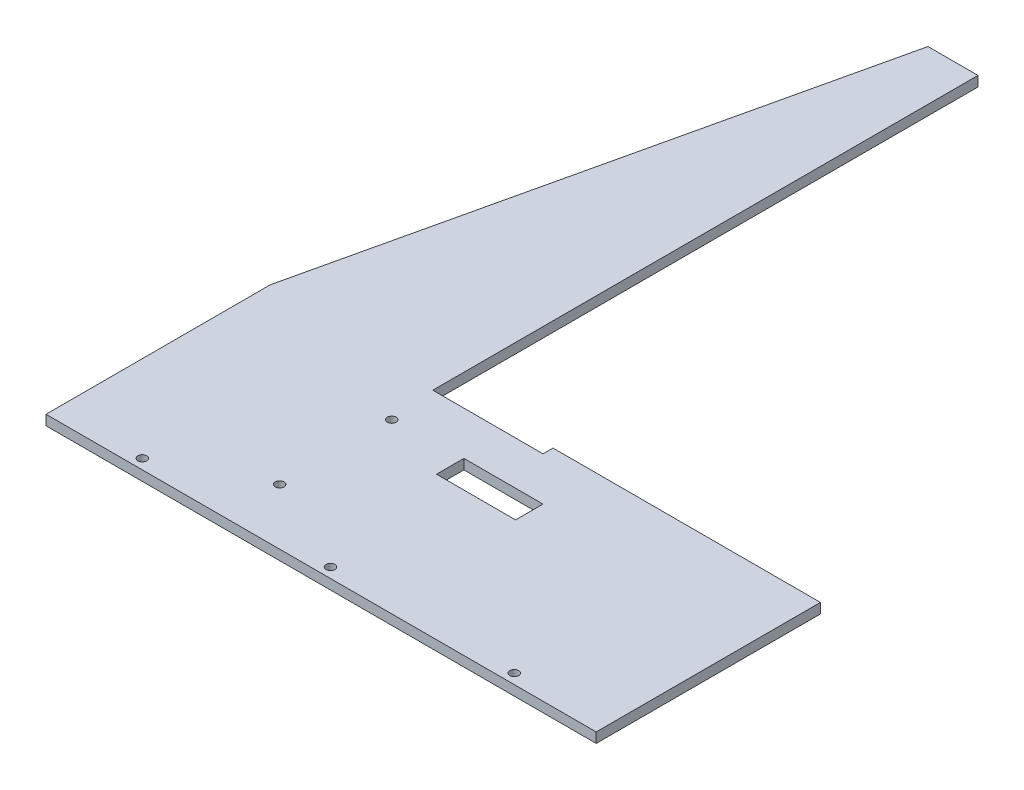
ISO-10303-21;
HEADER;
FILE_DESCRIPTION(('STEP AP214'),'2;1');
FILE_NAME('part.step','',(''),(''),'','','');
FILE_SCHEMA(('AUTOMOTIVE_DESIGN { 1 0 10303 214 1 1 1 1 }'));
ENDSEC;
DATA;
#1=APPLICATION_CONTEXT('core data for automotive mechanical design processes');
#2=APPLICATION_PROTOCOL_DEFINITION('international standard','automotive_design',2000,#1);
#3=PRODUCT_CONTEXT('',#1,'mechanical');
#4=PRODUCT('Part','Part','',(#3));
#5=PRODUCT_RELATED_PRODUCT_CATEGORY('part','',(#4));
#6=PRODUCT_DEFINITION_FORMATION('','',#4);
#7=PRODUCT_DEFINITION_CONTEXT('part definition',#1,'design');
#8=PRODUCT_DEFINITION('design','',#6,#7);
#9=PRODUCT_DEFINITION_SHAPE('','',#8);
#10=(LENGTH_UNIT() NAMED_UNIT(*) SI_UNIT(.MILLI.,.METRE.));
#11=(NAMED_UNIT(*) PLANE_ANGLE_UNIT() SI_UNIT($,.RADIAN.));
#12=(NAMED_UNIT(*) SI_UNIT($,.STERADIAN.) SOLID_ANGLE_UNIT());
#13=UNCERTAINTY_MEASURE_WITH_UNIT(LENGTH_MEASURE(1.E-05),#10,'distance_accuracy_value','');
#14=(GEOMETRIC_REPRESENTATION_CONTEXT(3) GLOBAL_UNCERTAINTY_ASSIGNED_CONTEXT((#13)) GLOBAL_UNIT_ASSIGNED_CONTEXT((#10,
#11,#12)) REPRESENTATION_CONTEXT('',''));
#15=CARTESIAN_POINT('',(0.,0.,0.));
#16=DIRECTION('',(0.,0.,1.));
#17=DIRECTION('',(1.,0.,0.));
#18=AXIS2_PLACEMENT_3D('',#15,#16,#17);
#19=CARTESIAN_POINT('',(330.,6.,0.));
#20=DIRECTION('',(0.,0.,-1.));
#21=DIRECTION('',(-1.,0.,0.));
#22=AXIS2_PLACEMENT_3D('',#19,#20,#21);
#23=PLANE('',#22);
#24=DIRECTION('',(1.,0.,0.));
#25=VECTOR('',#24,1.);
#26=CARTESIAN_POINT('',(330.,0.,0.));
#27=LINE('',#26,#25);
#28=CARTESIAN_POINT('',(0.,0.,0.));
#29=VERTEX_POINT('',#28);
#30=CARTESIAN_POINT('',(330.,0.,0.));
#31=VERTEX_POINT('',#30);
#32=EDGE_CURVE('E216',#29,#31,#27,.T.);
#33=ORIENTED_EDGE('',*,*,#32,.T.);
#34=DIRECTION('',(0.,-1.,0.));
#35=VECTOR('',#34,1.);
#36=CARTESIAN_POINT('',(330.,6.,0.));
#37=LINE('',#36,#35);
#38=CARTESIAN_POINT('',(330.,6.,0.));
#39=VERTEX_POINT('',#38);
#40=EDGE_CURVE('E11',#39,#31,#37,.T.);
#41=ORIENTED_EDGE('',*,*,#40,.F.);
#42=DIRECTION('',(1.,0.,0.));
#43=VECTOR('',#42,1.);
#44=CARTESIAN_POINT('',(330.,6.,0.));
#45=LINE('',#44,#43);
#46=CARTESIAN_POINT('',(0.,6.,0.));
#47=VERTEX_POINT('',#46);
#48=EDGE_CURVE('E217',#47,#39,#45,.T.);
#49=ORIENTED_EDGE('',*,*,#48,.F.);
#50=DIRECTION('',(0.,-1.,0.));
#51=VECTOR('',#50,1.);
#52=CARTESIAN_POINT('',(0.,6.,0.));
#53=LINE('',#52,#51);
#54=EDGE_CURVE('E234',#47,#29,#53,.T.);
#55=ORIENTED_EDGE('',*,*,#54,.T.);
#56=EDGE_LOOP('',(#33,#41,#49,#55));
#57=FACE_BOUND('',#56,.T.);
#58=ADVANCED_FACE('F37',(#57),#23,.F.);
#59=CARTESIAN_POINT('',(330.,6.,-134.5));
#60=DIRECTION('',(-1.,0.,0.));
#61=DIRECTION('',(0.,0.,1.));
#62=AXIS2_PLACEMENT_3D('',#59,#60,#61);
#63=PLANE('',#62);
#64=DIRECTION('',(0.,0.,-1.));
#65=VECTOR('',#64,1.);
#66=CARTESIAN_POINT('',(330.,0.,-134.5));
#67=LINE('',#66,#65);
#68=CARTESIAN_POINT('',(330.,0.,-134.5));
#69=VERTEX_POINT('',#68);
#70=EDGE_CURVE('E237',#31,#69,#67,.T.);
#71=ORIENTED_EDGE('',*,*,#70,.T.);
#72=DIRECTION('',(0.,-1.,0.));
#73=VECTOR('',#72,1.);
#74=CARTESIAN_POINT('',(330.,6.,-134.5));
#75=LINE('',#74,#73);
#76=CARTESIAN_POINT('',(330.,6.,-134.5));
#77=VERTEX_POINT('',#76);
#78=EDGE_CURVE('E44',#77,#69,#75,.T.);
#79=ORIENTED_EDGE('',*,*,#78,.F.);
#80=DIRECTION('',(0.,0.,-1.));
#81=VECTOR('',#80,1.);
#82=CARTESIAN_POINT('',(330.,6.,-134.5));
#83=LINE('',#82,#81);
#84=EDGE_CURVE('E220',#39,#77,#83,.T.);
#85=ORIENTED_EDGE('',*,*,#84,.F.);
#86=ORIENTED_EDGE('',*,*,#40,.T.);
#87=EDGE_LOOP('',(#71,#79,#85,#86));
#88=FACE_BOUND('',#87,.T.);
#89=ADVANCED_FACE('F281',(#88),#63,.F.);
#90=CARTESIAN_POINT('',(103.5,6.,-134.5));
#91=DIRECTION('',(0.,0.,1.));
#92=DIRECTION('',(1.,0.,0.));
#93=AXIS2_PLACEMENT_3D('',#90,#91,#92);
#94=PLANE('',#93);
#95=DIRECTION('',(-1.,0.,0.));
#96=VECTOR('',#95,1.);
#97=CARTESIAN_POINT('',(103.5,0.,-134.5));
#98=LINE('',#97,#96);
#99=CARTESIAN_POINT('',(169.6,0.,-134.5));
#100=VERTEX_POINT('',#99);
#101=EDGE_CURVE('E239',#69,#100,#98,.T.);
#102=ORIENTED_EDGE('',*,*,#101,.T.);
#103=DIRECTION('',(0.,1.,0.));
#104=VECTOR('',#103,1.);
#105=CARTESIAN_POINT('',(169.6,0.,-134.5));
#106=LINE('',#105,#104);
#107=CARTESIAN_POINT('',(169.6,6.,-134.5));
#108=VERTEX_POINT('',#107);
#109=EDGE_CURVE('E179',#100,#108,#106,.T.);
#110=ORIENTED_EDGE('',*,*,#109,.T.);
#111=DIRECTION('',(-1.,0.,0.));
#112=VECTOR('',#111,1.);
#113=CARTESIAN_POINT('',(103.5,6.,-134.5));
#114=LINE('',#113,#112);
#115=EDGE_CURVE('E223',#77,#108,#114,.T.);
#116=ORIENTED_EDGE('',*,*,#115,.F.);
#117=ORIENTED_EDGE('',*,*,#78,.T.);
#118=EDGE_LOOP('',(#102,#110,#116,#117));
#119=FACE_BOUND('',#118,.T.);
#120=ADVANCED_FACE('F264',(#119),#94,.F.);
#121=CARTESIAN_POINT('',(103.5,6.,-455.5));
#122=DIRECTION('',(-1.,0.,0.));
#123=DIRECTION('',(0.,0.,1.));
#124=AXIS2_PLACEMENT_3D('',#121,#122,#123);
#125=PLANE('',#124);
#126=DIRECTION('',(0.,0.,-1.));
#127=VECTOR('',#126,1.);
#128=CARTESIAN_POINT('',(103.5,0.,-455.5));
#129=LINE('',#128,#127);
#130=CARTESIAN_POINT('',(103.5,0.,-128.5));
#131=VERTEX_POINT('',#130);
#132=CARTESIAN_POINT('',(103.5,0.,-455.5));
#133=VERTEX_POINT('',#132);
#134=EDGE_CURVE('E242',#131,#133,#129,.T.);
#135=ORIENTED_EDGE('',*,*,#134,.T.);
#136=DIRECTION('',(0.,-1.,0.));
#137=VECTOR('',#136,1.);
#138=CARTESIAN_POINT('',(103.5,6.,-455.5));
#139=LINE('',#138,#137);
#140=CARTESIAN_POINT('',(103.5,6.,-455.5));
#141=VERTEX_POINT('',#140);
#142=EDGE_CURVE('E257',#141,#133,#139,.T.);
#143=ORIENTED_EDGE('',*,*,#142,.F.);
#144=DIRECTION('',(0.,0.,-1.));
#145=VECTOR('',#144,1.);
#146=CARTESIAN_POINT('',(103.5,6.,-455.5));
#147=LINE('',#146,#145);
#148=CARTESIAN_POINT('',(103.5,6.,-128.5));
#149=VERTEX_POINT('',#148);
#150=EDGE_CURVE('E226',#149,#141,#147,.T.);
#151=ORIENTED_EDGE('',*,*,#150,.F.);
#152=DIRECTION('',(0.,1.,0.));
#153=VECTOR('',#152,1.);
#154=CARTESIAN_POINT('',(103.5,0.,-128.5));
#155=LINE('',#154,#153);
#156=EDGE_CURVE('E175',#131,#149,#155,.T.);
#157=ORIENTED_EDGE('',*,*,#156,.F.);
#158=EDGE_LOOP('',(#135,#143,#151,#157));
#159=FACE_BOUND('',#158,.T.);
#160=ADVANCED_FACE('F300',(#159),#125,.F.);
#161=CARTESIAN_POINT('',(73.5,6.,-455.5));
#162=DIRECTION('',(0.,0.,1.));
#163=DIRECTION('',(1.,0.,0.));
#164=AXIS2_PLACEMENT_3D('',#161,#162,#163);
#165=PLANE('',#164);
#166=DIRECTION('',(-1.,0.,0.));
#167=VECTOR('',#166,1.);
#168=CARTESIAN_POINT('',(73.5,0.,-455.5));
#169=LINE('',#168,#167);
#170=CARTESIAN_POINT('',(73.5,0.,-455.5));
#171=VERTEX_POINT('',#170);
#172=EDGE_CURVE('E244',#133,#171,#169,.T.);
#173=ORIENTED_EDGE('',*,*,#172,.T.);
#174=DIRECTION('',(0.,-1.,0.));
#175=VECTOR('',#174,1.);
#176=CARTESIAN_POINT('',(73.5,6.,-455.5));
#177=LINE('',#176,#175);
#178=CARTESIAN_POINT('',(73.5,6.,-455.5));
#179=VERTEX_POINT('',#178);
#180=EDGE_CURVE('E254',#179,#171,#177,.T.);
#181=ORIENTED_EDGE('',*,*,#180,.F.);
#182=DIRECTION('',(-1.,0.,0.));
#183=VECTOR('',#182,1.);
#184=CARTESIAN_POINT('',(73.5,6.,-455.5));
#185=LINE('',#184,#183);
#186=EDGE_CURVE('E228',#141,#179,#185,.T.);
#187=ORIENTED_EDGE('',*,*,#186,.F.);
#188=ORIENTED_EDGE('',*,*,#142,.T.);
#189=EDGE_LOOP('',(#173,#181,#187,#188));
#190=FACE_BOUND('',#189,.T.);
#191=ADVANCED_FACE('F297',(#190),#165,.F.);
#192=CARTESIAN_POINT('',(0.,6.,-134.5));
#193=DIRECTION('',(0.974773625713798,0.,0.223195830186804));
#194=DIRECTION('',(0.223195830186804,0.,-0.974773625713798));
#195=AXIS2_PLACEMENT_3D('',#192,#193,#194);
#196=PLANE('',#195);
#197=DIRECTION('',(-0.223195830186804,0.,0.974773625713798));
#198=VECTOR('',#197,1.);
#199=CARTESIAN_POINT('',(0.,0.,-134.5));
#200=LINE('',#199,#198);
#201=CARTESIAN_POINT('',(0.,0.,-134.5));
#202=VERTEX_POINT('',#201);
#203=EDGE_CURVE('E246',#171,#202,#200,.T.);
#204=ORIENTED_EDGE('',*,*,#203,.T.);
#205=DIRECTION('',(0.,-1.,0.));
#206=VECTOR('',#205,1.);
#207=CARTESIAN_POINT('',(0.,6.,-134.5));
#208=LINE('',#207,#206);
#209=CARTESIAN_POINT('',(0.,6.,-134.5));
#210=VERTEX_POINT('',#209);
#211=EDGE_CURVE('E251',#210,#202,#208,.T.);
#212=ORIENTED_EDGE('',*,*,#211,.F.);
#213=DIRECTION('',(-0.223195830186804,0.,0.974773625713798));
#214=VECTOR('',#213,1.);
#215=CARTESIAN_POINT('',(0.,6.,-134.5));
#216=LINE('',#215,#214);
#217=EDGE_CURVE('E230',#179,#210,#216,.T.);
#218=ORIENTED_EDGE('',*,*,#217,.F.);
#219=ORIENTED_EDGE('',*,*,#180,.T.);
#220=EDGE_LOOP('',(#204,#212,#218,#219));
#221=FACE_BOUND('',#220,.T.);
#222=ADVANCED_FACE('F293',(#221),#196,.F.);
#223=CARTESIAN_POINT('',(0.,6.,0.));
#224=DIRECTION('',(1.,0.,0.));
#225=DIRECTION('',(0.,0.,-1.));
#226=AXIS2_PLACEMENT_3D('',#223,#224,#225);
#227=PLANE('',#226);
#228=DIRECTION('',(0.,0.,1.));
#229=VECTOR('',#228,1.);
#230=CARTESIAN_POINT('',(0.,0.,0.));
#231=LINE('',#230,#229);
#232=EDGE_CURVE('E221',#202,#29,#231,.T.);
#233=ORIENTED_EDGE('',*,*,#232,.T.);
#234=ORIENTED_EDGE('',*,*,#54,.F.);
#235=DIRECTION('',(0.,0.,1.));
#236=VECTOR('',#235,1.);
#237=CARTESIAN_POINT('',(0.,6.,0.));
#238=LINE('',#237,#236);
#239=EDGE_CURVE('E232',#210,#47,#238,.T.);
#240=ORIENTED_EDGE('',*,*,#239,.F.);
#241=ORIENTED_EDGE('',*,*,#211,.T.);
#242=EDGE_LOOP('',(#233,#234,#240,#241));
#243=FACE_BOUND('',#242,.T.);
#244=ADVANCED_FACE('F288',(#243),#227,.F.);
#245=CARTESIAN_POINT('',(0.,6.,0.));
#246=DIRECTION('',(0.,-1.,0.));
#247=DIRECTION('',(0.,0.,-1.));
#248=AXIS2_PLACEMENT_3D('',#245,#246,#247);
#249=PLANE('',#248);
#250=DIRECTION('',(1.,0.,0.));
#251=VECTOR('',#250,1.);
#252=CARTESIAN_POINT('',(148.249918256276,6.,-85.9520909443319));
#253=LINE('',#252,#251);
#254=CARTESIAN_POINT('',(148.249918256276,6.,-85.9520909443319));
#255=VERTEX_POINT('',#254);
#256=CARTESIAN_POINT('',(195.704065652897,6.,-85.9520909443319));
#257=VERTEX_POINT('',#256);
#258=EDGE_CURVE('E158',#255,#257,#253,.T.);
#259=ORIENTED_EDGE('',*,*,#258,.F.);
#260=DIRECTION('',(0.,0.,1.));
#261=VECTOR('',#260,1.);
#262=CARTESIAN_POINT('',(148.249918256276,6.,-102.401589247506));
#263=LINE('',#262,#261);
#264=CARTESIAN_POINT('',(148.249918256276,6.,-102.401589247506));
#265=VERTEX_POINT('',#264);
#266=EDGE_CURVE('E51',#265,#255,#263,.T.);
#267=ORIENTED_EDGE('',*,*,#266,.F.);
#268=DIRECTION('',(-1.,0.,0.));
#269=VECTOR('',#268,1.);
#270=CARTESIAN_POINT('',(148.249918256276,6.,-102.401589247506));
#271=LINE('',#270,#269);
#272=CARTESIAN_POINT('',(195.704065652897,6.,-102.401589247506));
#273=VERTEX_POINT('',#272);
#274=EDGE_CURVE('E149',#273,#265,#271,.T.);
#275=ORIENTED_EDGE('',*,*,#274,.F.);
#276=DIRECTION('',(0.,0.,-1.));
#277=VECTOR('',#276,1.);
#278=CARTESIAN_POINT('',(195.704065652897,6.,-102.401589247506));
#279=LINE('',#278,#277);
#280=EDGE_CURVE('E152',#257,#273,#279,.T.);
#281=ORIENTED_EDGE('',*,*,#280,.F.);
#282=EDGE_LOOP('',(#259,#267,#275,#281));
#283=FACE_BOUND('',#282,.T.);
#284=CARTESIAN_POINT('',(51.7499999999999,6.,-6.));
#285=DIRECTION('',(0.,1.,0.));
#286=DIRECTION('',(0.,0.,1.));
#287=AXIS2_PLACEMENT_3D('',#284,#285,#286);
#288=CIRCLE('',#287,2.64999999999999);
#289=CARTESIAN_POINT('',(51.7499999999999,6.,-3.35000000000002));
#290=VERTEX_POINT('',#289);
#291=EDGE_CURVE('E182',#290,#290,#288,.T.);
#292=ORIENTED_EDGE('',*,*,#291,.F.);
#293=EDGE_LOOP('',(#292));
#294=FACE_BOUND('',#293,.T.);
#295=CARTESIAN_POINT('',(164.625,6.,-6.));
#296=DIRECTION('',(0.,1.,0.));
#297=DIRECTION('',(0.,0.,1.));
#298=AXIS2_PLACEMENT_3D('',#295,#296,#297);
#299=CIRCLE('',#298,2.64999999999999);
#300=CARTESIAN_POINT('',(164.625,6.,-3.35000000000002));
#301=VERTEX_POINT('',#300);
#302=EDGE_CURVE('E192',#301,#301,#299,.T.);
#303=ORIENTED_EDGE('',*,*,#302,.F.);
#304=EDGE_LOOP('',(#303));
#305=FACE_BOUND('',#304,.T.);
#306=CARTESIAN_POINT('',(274.875,6.,-6.));
#307=DIRECTION('',(0.,1.,0.));
#308=DIRECTION('',(0.,0.,1.));
#309=AXIS2_PLACEMENT_3D('',#306,#307,#308);
#310=CIRCLE('',#309,2.64999999999999);
#311=CARTESIAN_POINT('',(274.875,6.,-3.35000000000002));
#312=VERTEX_POINT('',#311);
#313=EDGE_CURVE('E198',#312,#312,#310,.T.);
#314=ORIENTED_EDGE('',*,*,#313,.F.);
#315=EDGE_LOOP('',(#314));
#316=FACE_BOUND('',#315,.T.);
#317=CARTESIAN_POINT('',(106.5,6.,-33.625));
#318=DIRECTION('',(0.,1.,0.));
#319=DIRECTION('',(0.,0.,1.));
#320=AXIS2_PLACEMENT_3D('',#317,#318,#319);
#321=CIRCLE('',#320,2.64999999999999);
#322=CARTESIAN_POINT('',(106.5,6.,-30.975));
#323=VERTEX_POINT('',#322);
#324=EDGE_CURVE('E204',#323,#323,#321,.T.);
#325=ORIENTED_EDGE('',*,*,#324,.F.);
#326=EDGE_LOOP('',(#325));
#327=FACE_BOUND('',#326,.T.);
#328=CARTESIAN_POINT('',(106.5,6.,-100.875));
#329=DIRECTION('',(0.,1.,0.));
#330=DIRECTION('',(0.,0.,1.));
#331=AXIS2_PLACEMENT_3D('',#328,#329,#330);
#332=CIRCLE('',#331,2.64999999999999);
#333=CARTESIAN_POINT('',(106.5,6.,-98.225));
#334=VERTEX_POINT('',#333);
#335=EDGE_CURVE('E210',#334,#334,#332,.T.);
#336=ORIENTED_EDGE('',*,*,#335,.F.);
#337=EDGE_LOOP('',(#336));
#338=FACE_BOUND('',#337,.T.);
#339=DIRECTION('',(1.,0.,0.));
#340=VECTOR('',#339,1.);
#341=CARTESIAN_POINT('',(103.5,6.,-128.5));
#342=LINE('',#341,#340);
#343=CARTESIAN_POINT('',(169.6,6.,-128.5));
#344=VERTEX_POINT('',#343);
#345=EDGE_CURVE('E164',#149,#344,#342,.T.);
#346=ORIENTED_EDGE('',*,*,#345,.F.);
#347=ORIENTED_EDGE('',*,*,#150,.T.);
#348=ORIENTED_EDGE('',*,*,#186,.T.);
#349=ORIENTED_EDGE('',*,*,#217,.T.);
#350=ORIENTED_EDGE('',*,*,#239,.T.);
#351=ORIENTED_EDGE('',*,*,#48,.T.);
#352=ORIENTED_EDGE('',*,*,#84,.T.);
#353=ORIENTED_EDGE('',*,*,#115,.T.);
#354=DIRECTION('',(0.,0.,-1.));
#355=VECTOR('',#354,1.);
#356=CARTESIAN_POINT('',(169.6,6.,-134.5));
#357=LINE('',#356,#355);
#358=EDGE_CURVE('E172',#344,#108,#357,.T.);
#359=ORIENTED_EDGE('',*,*,#358,.F.);
#360=EDGE_LOOP('',(#346,#347,#348,#349,#350,#351,#352,#353,#359));
#361=FACE_BOUND('',#360,.T.);
#362=ADVANCED_FACE('F278',(#283,#294,#305,#316,#327,#338,#361),#249,.F.);
#363=CARTESIAN_POINT('',(0.,0.,0.));
#364=DIRECTION('',(0.,-1.,0.));
#365=DIRECTION('',(0.,0.,-1.));
#366=AXIS2_PLACEMENT_3D('',#363,#364,#365);
#367=PLANE('',#366);
#368=DIRECTION('',(0.,0.,1.));
#369=VECTOR('',#368,1.);
#370=CARTESIAN_POINT('',(148.249918256276,0.,-102.401589247506));
#371=LINE('',#370,#369);
#372=CARTESIAN_POINT('',(148.249918256276,0.,-102.401589247506));
#373=VERTEX_POINT('',#372);
#374=CARTESIAN_POINT('',(148.249918256276,0.,-85.9520909443319));
#375=VERTEX_POINT('',#374);
#376=EDGE_CURVE('E133',#373,#375,#371,.T.);
#377=ORIENTED_EDGE('',*,*,#376,.T.);
#378=DIRECTION('',(1.,0.,0.));
#379=VECTOR('',#378,1.);
#380=CARTESIAN_POINT('',(148.249918256276,0.,-85.9520909443319));
#381=LINE('',#380,#379);
#382=CARTESIAN_POINT('',(195.704065652897,0.,-85.9520909443319));
#383=VERTEX_POINT('',#382);
#384=EDGE_CURVE('E142',#375,#383,#381,.T.);
#385=ORIENTED_EDGE('',*,*,#384,.T.);
#386=DIRECTION('',(0.,0.,-1.));
#387=VECTOR('',#386,1.);
#388=CARTESIAN_POINT('',(195.704065652897,0.,-102.401589247506));
#389=LINE('',#388,#387);
#390=CARTESIAN_POINT('',(195.704065652897,0.,-102.401589247506));
#391=VERTEX_POINT('',#390);
#392=EDGE_CURVE('E59',#383,#391,#389,.T.);
#393=ORIENTED_EDGE('',*,*,#392,.T.);
#394=DIRECTION('',(-1.,0.,0.));
#395=VECTOR('',#394,1.);
#396=CARTESIAN_POINT('',(148.249918256276,0.,-102.401589247506));
#397=LINE('',#396,#395);
#398=EDGE_CURVE('E139',#391,#373,#397,.T.);
#399=ORIENTED_EDGE('',*,*,#398,.T.);
#400=EDGE_LOOP('',(#377,#385,#393,#399));
#401=FACE_BOUND('',#400,.T.);
#402=ORIENTED_EDGE('',*,*,#134,.F.);
#403=DIRECTION('',(1.,0.,0.));
#404=VECTOR('',#403,1.);
#405=CARTESIAN_POINT('',(103.5,0.,-128.5));
#406=LINE('',#405,#404);
#407=CARTESIAN_POINT('',(169.6,0.,-128.5));
#408=VERTEX_POINT('',#407);
#409=EDGE_CURVE('E168',#131,#408,#406,.T.);
#410=ORIENTED_EDGE('',*,*,#409,.T.);
#411=DIRECTION('',(0.,0.,-1.));
#412=VECTOR('',#411,1.);
#413=CARTESIAN_POINT('',(169.6,0.,-134.5));
#414=LINE('',#413,#412);
#415=EDGE_CURVE('E171',#408,#100,#414,.T.);
#416=ORIENTED_EDGE('',*,*,#415,.T.);
#417=ORIENTED_EDGE('',*,*,#101,.F.);
#418=ORIENTED_EDGE('',*,*,#70,.F.);
#419=ORIENTED_EDGE('',*,*,#32,.F.);
#420=ORIENTED_EDGE('',*,*,#232,.F.);
#421=ORIENTED_EDGE('',*,*,#203,.F.);
#422=ORIENTED_EDGE('',*,*,#172,.F.);
#423=EDGE_LOOP('',(#402,#410,#416,#417,#418,#419,#420,#421,#422));
#424=FACE_BOUND('',#423,.T.);
#425=CARTESIAN_POINT('',(51.7499999999999,0.,-6.));
#426=DIRECTION('',(0.,1.,0.));
#427=DIRECTION('',(0.,0.,1.));
#428=AXIS2_PLACEMENT_3D('',#425,#426,#427);
#429=CIRCLE('',#428,2.64999999999999);
#430=CARTESIAN_POINT('',(51.7499999999999,0.,-3.35000000000002));
#431=VERTEX_POINT('',#430);
#432=EDGE_CURVE('E189',#431,#431,#429,.T.);
#433=ORIENTED_EDGE('',*,*,#432,.T.);
#434=EDGE_LOOP('',(#433));
#435=FACE_BOUND('',#434,.T.);
#436=CARTESIAN_POINT('',(164.625,0.,-6.));
#437=DIRECTION('',(0.,1.,0.));
#438=DIRECTION('',(0.,0.,1.));
#439=AXIS2_PLACEMENT_3D('',#436,#437,#438);
#440=CIRCLE('',#439,2.64999999999999);
#441=CARTESIAN_POINT('',(164.625,0.,-3.35000000000002));
#442=VERTEX_POINT('',#441);
#443=EDGE_CURVE('E195',#442,#442,#440,.T.);
#444=ORIENTED_EDGE('',*,*,#443,.T.);
#445=EDGE_LOOP('',(#444));
#446=FACE_BOUND('',#445,.T.);
#447=CARTESIAN_POINT('',(274.875,0.,-6.));
#448=DIRECTION('',(0.,1.,0.));
#449=DIRECTION('',(0.,0.,1.));
#450=AXIS2_PLACEMENT_3D('',#447,#448,#449);
#451=CIRCLE('',#450,2.64999999999999);
#452=CARTESIAN_POINT('',(274.875,0.,-3.35000000000002));
#453=VERTEX_POINT('',#452);
#454=EDGE_CURVE('E201',#453,#453,#451,.T.);
#455=ORIENTED_EDGE('',*,*,#454,.T.);
#456=EDGE_LOOP('',(#455));
#457=FACE_BOUND('',#456,.T.);
#458=CARTESIAN_POINT('',(106.5,0.,-33.625));
#459=DIRECTION('',(0.,1.,0.));
#460=DIRECTION('',(0.,0.,1.));
#461=AXIS2_PLACEMENT_3D('',#458,#459,#460);
#462=CIRCLE('',#461,2.64999999999999);
#463=CARTESIAN_POINT('',(106.5,0.,-30.975));
#464=VERTEX_POINT('',#463);
#465=EDGE_CURVE('E207',#464,#464,#462,.T.);
#466=ORIENTED_EDGE('',*,*,#465,.T.);
#467=EDGE_LOOP('',(#466));
#468=FACE_BOUND('',#467,.T.);
#469=CARTESIAN_POINT('',(106.5,0.,-100.875));
#470=DIRECTION('',(0.,1.,0.));
#471=DIRECTION('',(0.,0.,1.));
#472=AXIS2_PLACEMENT_3D('',#469,#470,#471);
#473=CIRCLE('',#472,2.64999999999999);
#474=CARTESIAN_POINT('',(106.5,0.,-98.225));
#475=VERTEX_POINT('',#474);
#476=EDGE_CURVE('E213',#475,#475,#473,.T.);
#477=ORIENTED_EDGE('',*,*,#476,.T.);
#478=EDGE_LOOP('',(#477));
#479=FACE_BOUND('',#478,.T.);
#480=ADVANCED_FACE('F146',(#401,#424,#435,#446,#457,#468,#479),#367,.T.);
#481=CARTESIAN_POINT('',(106.5,6.,-100.875));
#482=DIRECTION('',(0.,1.,0.));
#483=DIRECTION('',(0.,0.,1.));
#484=AXIS2_PLACEMENT_3D('',#481,#482,#483);
#485=CYLINDRICAL_SURFACE('',#484,2.64999999999999);
#486=ORIENTED_EDGE('',*,*,#476,.F.);
#487=EDGE_LOOP('',(#486));
#488=FACE_BOUND('',#487,.T.);
#489=ORIENTED_EDGE('',*,*,#335,.T.);
#490=EDGE_LOOP('',(#489));
#491=FACE_BOUND('',#490,.T.);
#492=ADVANCED_FACE('F371',(#488,#491),#485,.F.);
#493=CARTESIAN_POINT('',(106.5,6.,-33.625));
#494=DIRECTION('',(0.,1.,0.));
#495=DIRECTION('',(0.,0.,1.));
#496=AXIS2_PLACEMENT_3D('',#493,#494,#495);
#497=CYLINDRICAL_SURFACE('',#496,2.64999999999999);
#498=ORIENTED_EDGE('',*,*,#465,.F.);
#499=EDGE_LOOP('',(#498));
#500=FACE_BOUND('',#499,.T.);
#501=ORIENTED_EDGE('',*,*,#324,.T.);
#502=EDGE_LOOP('',(#501));
#503=FACE_BOUND('',#502,.T.);
#504=ADVANCED_FACE('F379',(#500,#503),#497,.F.);
#505=CARTESIAN_POINT('',(274.875,6.,-6.));
#506=DIRECTION('',(0.,1.,0.));
#507=DIRECTION('',(0.,0.,1.));
#508=AXIS2_PLACEMENT_3D('',#505,#506,#507);
#509=CYLINDRICAL_SURFACE('',#508,2.64999999999999);
#510=ORIENTED_EDGE('',*,*,#454,.F.);
#511=EDGE_LOOP('',(#510));
#512=FACE_BOUND('',#511,.T.);
#513=ORIENTED_EDGE('',*,*,#313,.T.);
#514=EDGE_LOOP('',(#513));
#515=FACE_BOUND('',#514,.T.);
#516=ADVANCED_FACE('F389',(#512,#515),#509,.F.);
#517=CARTESIAN_POINT('',(164.625,6.,-6.));
#518=DIRECTION('',(0.,1.,0.));
#519=DIRECTION('',(0.,0.,1.));
#520=AXIS2_PLACEMENT_3D('',#517,#518,#519);
#521=CYLINDRICAL_SURFACE('',#520,2.64999999999999);
#522=ORIENTED_EDGE('',*,*,#443,.F.);
#523=EDGE_LOOP('',(#522));
#524=FACE_BOUND('',#523,.T.);
#525=ORIENTED_EDGE('',*,*,#302,.T.);
#526=EDGE_LOOP('',(#525));
#527=FACE_BOUND('',#526,.T.);
#528=ADVANCED_FACE('F399',(#524,#527),#521,.F.);
#529=CARTESIAN_POINT('',(51.7499999999999,6.,-6.));
#530=DIRECTION('',(0.,1.,0.));
#531=DIRECTION('',(0.,0.,1.));
#532=AXIS2_PLACEMENT_3D('',#529,#530,#531);
#533=CYLINDRICAL_SURFACE('',#532,2.64999999999999);
#534=ORIENTED_EDGE('',*,*,#432,.F.);
#535=EDGE_LOOP('',(#534));
#536=FACE_BOUND('',#535,.T.);
#537=ORIENTED_EDGE('',*,*,#291,.T.);
#538=EDGE_LOOP('',(#537));
#539=FACE_BOUND('',#538,.T.);
#540=ADVANCED_FACE('F409',(#536,#539),#533,.F.);
#541=CARTESIAN_POINT('',(169.6,0.,-134.5));
#542=DIRECTION('',(1.,0.,0.));
#543=DIRECTION('',(0.,0.,-1.));
#544=AXIS2_PLACEMENT_3D('',#541,#542,#543);
#545=PLANE('',#544);
#546=ORIENTED_EDGE('',*,*,#358,.T.);
#547=ORIENTED_EDGE('',*,*,#109,.F.);
#548=ORIENTED_EDGE('',*,*,#415,.F.);
#549=DIRECTION('',(0.,1.,0.));
#550=VECTOR('',#549,1.);
#551=CARTESIAN_POINT('',(169.6,0.,-128.5));
#552=LINE('',#551,#550);
#553=EDGE_CURVE('E183',#408,#344,#552,.T.);
#554=ORIENTED_EDGE('',*,*,#553,.T.);
#555=EDGE_LOOP('',(#546,#547,#548,#554));
#556=FACE_BOUND('',#555,.T.);
#557=ADVANCED_FACE('F271',(#556),#545,.F.);
#558=CARTESIAN_POINT('',(103.5,0.,-128.5));
#559=DIRECTION('',(0.,0.,1.));
#560=DIRECTION('',(1.,0.,0.));
#561=AXIS2_PLACEMENT_3D('',#558,#559,#560);
#562=PLANE('',#561);
#563=ORIENTED_EDGE('',*,*,#345,.T.);
#564=ORIENTED_EDGE('',*,*,#553,.F.);
#565=ORIENTED_EDGE('',*,*,#409,.F.);
#566=ORIENTED_EDGE('',*,*,#156,.T.);
#567=EDGE_LOOP('',(#563,#564,#565,#566));
#568=FACE_BOUND('',#567,.T.);
#569=ADVANCED_FACE('F273',(#568),#562,.F.);
#570=CARTESIAN_POINT('',(148.249918256276,0.,-102.401589247506));
#571=DIRECTION('',(-1.,0.,0.));
#572=DIRECTION('',(0.,0.,1.));
#573=AXIS2_PLACEMENT_3D('',#570,#571,#572);
#574=PLANE('',#573);
#575=ORIENTED_EDGE('',*,*,#266,.T.);
#576=DIRECTION('',(0.,1.,0.));
#577=VECTOR('',#576,1.);
#578=CARTESIAN_POINT('',(148.249918256276,0.,-85.9520909443319));
#579=LINE('',#578,#577);
#580=EDGE_CURVE('E129',#375,#255,#579,.T.);
#581=ORIENTED_EDGE('',*,*,#580,.F.);
#582=ORIENTED_EDGE('',*,*,#376,.F.);
#583=DIRECTION('',(0.,1.,0.));
#584=VECTOR('',#583,1.);
#585=CARTESIAN_POINT('',(148.249918256276,0.,-102.401589247506));
#586=LINE('',#585,#584);
#587=EDGE_CURVE('E162',#373,#265,#586,.T.);
#588=ORIENTED_EDGE('',*,*,#587,.T.);
#589=EDGE_LOOP('',(#575,#581,#582,#588));
#590=FACE_BOUND('',#589,.T.);
#591=ADVANCED_FACE('F131',(#590),#574,.F.);
#592=CARTESIAN_POINT('',(148.249918256276,0.,-102.401589247506));
#593=DIRECTION('',(0.,0.,-1.));
#594=DIRECTION('',(-1.,0.,0.));
#595=AXIS2_PLACEMENT_3D('',#592,#593,#594);
#596=PLANE('',#595);
#597=ORIENTED_EDGE('',*,*,#274,.T.);
#598=ORIENTED_EDGE('',*,*,#587,.F.);
#599=ORIENTED_EDGE('',*,*,#398,.F.);
#600=DIRECTION('',(0.,1.,0.));
#601=VECTOR('',#600,1.);
#602=CARTESIAN_POINT('',(195.704065652897,0.,-102.401589247506));
#603=LINE('',#602,#601);
#604=EDGE_CURVE('E165',#391,#273,#603,.T.);
#605=ORIENTED_EDGE('',*,*,#604,.T.);
#606=EDGE_LOOP('',(#597,#598,#599,#605));
#607=FACE_BOUND('',#606,.T.);
#608=ADVANCED_FACE('F444',(#607),#596,.F.);
#609=CARTESIAN_POINT('',(195.704065652897,0.,-102.401589247506));
#610=DIRECTION('',(1.,0.,0.));
#611=DIRECTION('',(0.,0.,-1.));
#612=AXIS2_PLACEMENT_3D('',#609,#610,#611);
#613=PLANE('',#612);
#614=ORIENTED_EDGE('',*,*,#280,.T.);
#615=ORIENTED_EDGE('',*,*,#604,.F.);
#616=ORIENTED_EDGE('',*,*,#392,.F.);
#617=DIRECTION('',(0.,1.,0.));
#618=VECTOR('',#617,1.);
#619=CARTESIAN_POINT('',(195.704065652897,0.,-85.9520909443319));
#620=LINE('',#619,#618);
#621=EDGE_CURVE('E138',#383,#257,#620,.T.);
#622=ORIENTED_EDGE('',*,*,#621,.T.);
#623=EDGE_LOOP('',(#614,#615,#616,#622));
#624=FACE_BOUND('',#623,.T.);
#625=ADVANCED_FACE('F453',(#624),#613,.F.);
#626=CARTESIAN_POINT('',(148.249918256276,0.,-85.9520909443319));
#627=DIRECTION('',(0.,0.,1.));
#628=DIRECTION('',(1.,0.,0.));
#629=AXIS2_PLACEMENT_3D('',#626,#627,#628);
#630=PLANE('',#629);
#631=ORIENTED_EDGE('',*,*,#258,.T.);
#632=ORIENTED_EDGE('',*,*,#621,.F.);
#633=ORIENTED_EDGE('',*,*,#384,.F.);
#634=ORIENTED_EDGE('',*,*,#580,.T.);
#635=EDGE_LOOP('',(#631,#632,#633,#634));
#636=FACE_BOUND('',#635,.T.);
#637=ADVANCED_FACE('F143',(#636),#630,.F.);
#638=CLOSED_SHELL('',(#58,#89,#120,#160,#191,#222,#244,#362,#480,#492,#504,#516,#528,#540,#557,
#569,#591,#608,#625,#637));
#639=MANIFOLD_SOLID_BREP('B2',#638);
#640=ADVANCED_BREP_SHAPE_REPRESENTATION('',(#18,#639),#14);
#641=SHAPE_DEFINITION_REPRESENTATION(#9,#640);
ENDSEC;
END-ISO-10303-21;
